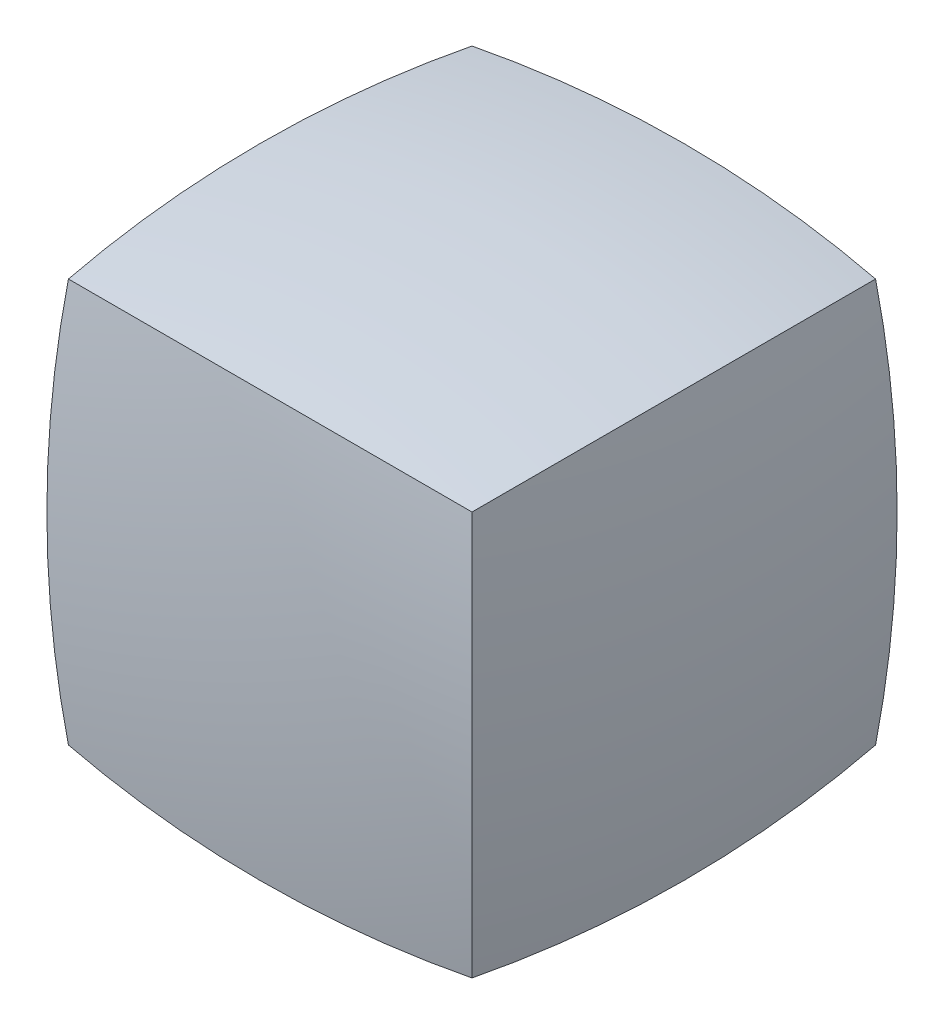
ISO-10303-21;
HEADER;
FILE_DESCRIPTION(('STEP AP214'),'2;1');
FILE_NAME('part.step','',(''),(''),'','','');
FILE_SCHEMA(('AUTOMOTIVE_DESIGN { 1 0 10303 214 1 1 1 1 }'));
ENDSEC;
DATA;
#1=APPLICATION_CONTEXT('core data for automotive mechanical design processes');
#2=APPLICATION_PROTOCOL_DEFINITION('international standard','automotive_design',2000,#1);
#3=PRODUCT_CONTEXT('',#1,'mechanical');
#4=PRODUCT('Part','Part','',(#3));
#5=PRODUCT_RELATED_PRODUCT_CATEGORY('part','',(#4));
#6=PRODUCT_DEFINITION_FORMATION('','',#4);
#7=PRODUCT_DEFINITION_CONTEXT('part definition',#1,'design');
#8=PRODUCT_DEFINITION('design','',#6,#7);
#9=PRODUCT_DEFINITION_SHAPE('','',#8);
#10=(LENGTH_UNIT() NAMED_UNIT(*) SI_UNIT(.MILLI.,.METRE.));
#11=(NAMED_UNIT(*) PLANE_ANGLE_UNIT() SI_UNIT($,.RADIAN.));
#12=(NAMED_UNIT(*) SI_UNIT($,.STERADIAN.) SOLID_ANGLE_UNIT());
#13=UNCERTAINTY_MEASURE_WITH_UNIT(LENGTH_MEASURE(1.E-05),#10,'distance_accuracy_value','');
#14=(GEOMETRIC_REPRESENTATION_CONTEXT(3) GLOBAL_UNCERTAINTY_ASSIGNED_CONTEXT((#13)) GLOBAL_UNIT_ASSIGNED_CONTEXT((#10,
#11,#12)) REPRESENTATION_CONTEXT('',''));
#15=CARTESIAN_POINT('',(0.,0.,0.));
#16=DIRECTION('',(0.,0.,1.));
#17=DIRECTION('',(1.,0.,0.));
#18=AXIS2_PLACEMENT_3D('',#15,#16,#17);
#19=CARTESIAN_POINT('',(-9.22831784490347E-13,88.1031249515609,9.34974848822185E-13));
#20=DIRECTION('',(0.,0.,1.));
#21=DIRECTION('',(0.,1.,0.));
#22=AXIS2_PLACEMENT_3D('',#19,#20,#21);
#23=SPHERICAL_SURFACE('',#22,101.6);
#24=CARTESIAN_POINT('',(-44.0515624757809,44.0515624757804,4.67487424411092E-13));
#25=DIRECTION('',(0.707106781186544,0.707106781186551,0.));
#26=DIRECTION('',(-0.707106781186551,0.707106781186544,0.));
#27=AXIS2_PLACEMENT_3D('',#24,#25,#26);
#28=CIRCLE('',#27,80.258829339113);
#29=CARTESIAN_POINT('',(12.0560620293977,-12.0560620293977,12.0560620293978));
#30=VERTEX_POINT('',#29);
#31=CARTESIAN_POINT('',(12.0560620293978,-12.0560620293975,-12.0560620293976));
#32=VERTEX_POINT('',#31);
#33=EDGE_CURVE('E85',#30,#32,#28,.T.);
#34=ORIENTED_EDGE('',*,*,#33,.F.);
#35=CARTESIAN_POINT('',(-3.07610594830116E-13,44.0515624757804,-44.05156247578));
#36=DIRECTION('',(0.,-0.707106781186544,-0.707106781186551));
#37=DIRECTION('',(0.,0.707106781186551,-0.707106781186544));
#38=AXIS2_PLACEMENT_3D('',#35,#36,#37);
#39=CIRCLE('',#38,80.2588293391125);
#40=CARTESIAN_POINT('',(-12.0560620293978,-12.0560620293979,12.0560620293977));
#41=VERTEX_POINT('',#40);
#42=EDGE_CURVE('E83',#30,#41,#39,.T.);
#43=ORIENTED_EDGE('',*,*,#42,.T.);
#44=CARTESIAN_POINT('',(44.05156247578,44.0515624757804,7.75098019241208E-13));
#45=DIRECTION('',(-0.707106781186551,0.707106781186544,0.));
#46=DIRECTION('',(-0.707106781186544,-0.707106781186551,0.));
#47=AXIS2_PLACEMENT_3D('',#44,#45,#46);
#48=CIRCLE('',#47,80.2588293391125);
#49=CARTESIAN_POINT('',(-12.0560620293976,-12.0560620293977,-12.0560620293978));
#50=VERTEX_POINT('',#49);
#51=EDGE_CURVE('E92',#50,#41,#48,.T.);
#52=ORIENTED_EDGE('',*,*,#51,.F.);
#53=CARTESIAN_POINT('',(-9.22831784490347E-13,44.0515624757804,44.0515624757809));
#54=DIRECTION('',(0.,0.707106781186551,-0.707106781186544));
#55=DIRECTION('',(0.,0.707106781186544,0.707106781186551));
#56=AXIS2_PLACEMENT_3D('',#53,#54,#55);
#57=CIRCLE('',#56,80.258829339113);
#58=EDGE_CURVE('E95',#32,#50,#57,.T.);
#59=ORIENTED_EDGE('',*,*,#58,.F.);
#60=EDGE_LOOP('',(#34,#43,#52,#59));
#61=FACE_BOUND('',#60,.T.);
#62=ADVANCED_FACE('F34',(#61),#23,.T.);
#63=CARTESIAN_POINT('',(88.1031249515609,0.,6.15221189660231E-13));
#64=DIRECTION('',(0.,-1.,0.));
#65=DIRECTION('',(1.,0.,0.));
#66=AXIS2_PLACEMENT_3D('',#63,#64,#65);
#67=SPHERICAL_SURFACE('',#66,101.6);
#68=CARTESIAN_POINT('',(44.0515624757806,0.,-44.0515624757801));
#69=DIRECTION('',(-0.707106781186544,0.,-0.707106781186551));
#70=DIRECTION('',(-0.707106781186551,0.,0.707106781186544));
#71=AXIS2_PLACEMENT_3D('',#68,#69,#70);
#72=CIRCLE('',#71,80.2588293391127);
#73=CARTESIAN_POINT('',(-12.0560620293978,12.0560620293978,12.0560620293977));
#74=VERTEX_POINT('',#73);
#75=EDGE_CURVE('E99',#41,#74,#72,.T.);
#76=ORIENTED_EDGE('',*,*,#75,.T.);
#77=CARTESIAN_POINT('',(44.05156247578,-44.0515624757805,1.47733765249139E-13));
#78=DIRECTION('',(-0.707106781186551,-0.707106781186544,0.));
#79=DIRECTION('',(0.707106781186544,-0.707106781186551,0.));
#80=AXIS2_PLACEMENT_3D('',#77,#78,#79);
#81=CIRCLE('',#80,80.2588293391125);
#82=CARTESIAN_POINT('',(-12.0560620293976,12.0560620293979,-12.0560620293978));
#83=VERTEX_POINT('',#82);
#84=EDGE_CURVE('E49',#74,#83,#81,.T.);
#85=ORIENTED_EDGE('',*,*,#84,.T.);
#86=CARTESIAN_POINT('',(44.05156247578,0.,44.0515624757807));
#87=DIRECTION('',(0.707106781186554,0.,-0.707106781186541));
#88=DIRECTION('',(-0.707106781186541,0.,-0.707106781186554));
#89=AXIS2_PLACEMENT_3D('',#86,#87,#88);
#90=CIRCLE('',#89,80.2588293391127);
#91=EDGE_CURVE('E89',#50,#83,#90,.T.);
#92=ORIENTED_EDGE('',*,*,#91,.F.);
#93=ORIENTED_EDGE('',*,*,#51,.T.);
#94=EDGE_LOOP('',(#76,#85,#92,#93));
#95=FACE_BOUND('',#94,.T.);
#96=ADVANCED_FACE('F106',(#95),#67,.T.);
#97=CARTESIAN_POINT('',(-9.22831784490347E-13,0.,88.1031249515609));
#98=DIRECTION('',(0.,-1.,0.));
#99=DIRECTION('',(0.,0.,1.));
#100=AXIS2_PLACEMENT_3D('',#97,#98,#99);
#101=SPHERICAL_SURFACE('',#100,101.6);
#102=ORIENTED_EDGE('',*,*,#91,.T.);
#103=CARTESIAN_POINT('',(-9.22831784490347E-13,-44.0515624757805,44.0515624757803));
#104=DIRECTION('',(0.,-0.707106781186546,-0.707106781186549));
#105=DIRECTION('',(0.,0.707106781186549,-0.707106781186546));
#106=AXIS2_PLACEMENT_3D('',#103,#104,#105);
#107=CIRCLE('',#106,80.2588293391127);
#108=CARTESIAN_POINT('',(12.0560620293977,12.0560620293976,-12.0560620293976));
#109=VERTEX_POINT('',#108);
#110=EDGE_CURVE('E79',#83,#109,#107,.T.);
#111=ORIENTED_EDGE('',*,*,#110,.T.);
#112=CARTESIAN_POINT('',(-44.0515624757809,0.,44.0515624757804));
#113=DIRECTION('',(0.707106781186544,0.,0.707106781186551));
#114=DIRECTION('',(0.707106781186551,0.,-0.707106781186544));
#115=AXIS2_PLACEMENT_3D('',#112,#113,#114);
#116=CIRCLE('',#115,80.258829339113);
#117=EDGE_CURVE('E78',#32,#109,#116,.T.);
#118=ORIENTED_EDGE('',*,*,#117,.F.);
#119=ORIENTED_EDGE('',*,*,#58,.T.);
#120=EDGE_LOOP('',(#102,#111,#118,#119));
#121=FACE_BOUND('',#120,.T.);
#122=ADVANCED_FACE('F103',(#121),#101,.T.);
#123=CARTESIAN_POINT('',(-88.1031249515609,0.,0.));
#124=DIRECTION('',(0.,-1.,0.));
#125=DIRECTION('',(-1.,0.,0.));
#126=AXIS2_PLACEMENT_3D('',#123,#124,#125);
#127=SPHERICAL_SURFACE('',#126,101.6);
#128=ORIENTED_EDGE('',*,*,#117,.T.);
#129=CARTESIAN_POINT('',(-44.0515624757809,-44.0515624757805,-1.59876829580977E-13));
#130=DIRECTION('',(0.707106781186544,-0.707106781186551,0.));
#131=DIRECTION('',(0.707106781186551,0.707106781186544,0.));
#132=AXIS2_PLACEMENT_3D('',#129,#130,#131);
#133=CIRCLE('',#132,80.258829339113);
#134=CARTESIAN_POINT('',(12.0560620293977,12.0560620293976,12.0560620293978));
#135=VERTEX_POINT('',#134);
#136=EDGE_CURVE('E72',#109,#135,#133,.T.);
#137=ORIENTED_EDGE('',*,*,#136,.T.);
#138=CARTESIAN_POINT('',(-44.0515624757803,0.,-44.0515624757804));
#139=DIRECTION('',(0.707106781186549,0.,-0.707106781186546));
#140=DIRECTION('',(-0.707106781186546,0.,-0.707106781186549));
#141=AXIS2_PLACEMENT_3D('',#138,#139,#140);
#142=CIRCLE('',#141,80.2588293391127);
#143=EDGE_CURVE('E42',#135,#30,#142,.T.);
#144=ORIENTED_EDGE('',*,*,#143,.T.);
#145=ORIENTED_EDGE('',*,*,#33,.T.);
#146=EDGE_LOOP('',(#128,#137,#144,#145));
#147=FACE_BOUND('',#146,.T.);
#148=ADVANCED_FACE('F36',(#147),#127,.T.);
#149=CARTESIAN_POINT('',(3.07610594830116E-13,0.,-88.1031249515609));
#150=DIRECTION('',(0.,-1.,0.));
#151=DIRECTION('',(0.,0.,-1.));
#152=AXIS2_PLACEMENT_3D('',#149,#150,#151);
#153=SPHERICAL_SURFACE('',#152,101.6);
#154=ORIENTED_EDGE('',*,*,#143,.F.);
#155=CARTESIAN_POINT('',(-3.07610594830116E-13,-44.0515624757805,-44.0515624757806));
#156=DIRECTION('',(0.,-0.707106781186549,0.707106781186546));
#157=DIRECTION('',(0.,-0.707106781186546,-0.707106781186549));
#158=AXIS2_PLACEMENT_3D('',#155,#156,#157);
#159=CIRCLE('',#158,80.2588293391128);
#160=EDGE_CURVE('E11',#135,#74,#159,.T.);
#161=ORIENTED_EDGE('',*,*,#160,.T.);
#162=ORIENTED_EDGE('',*,*,#75,.F.);
#163=ORIENTED_EDGE('',*,*,#42,.F.);
#164=EDGE_LOOP('',(#154,#161,#162,#163));
#165=FACE_BOUND('',#164,.T.);
#166=ADVANCED_FACE('F81',(#165),#153,.T.);
#167=CARTESIAN_POINT('',(-9.22831784490347E-13,-88.1031249515609,-3.19753659161953E-13));
#168=DIRECTION('',(0.,0.,-1.));
#169=DIRECTION('',(0.,-1.,0.));
#170=AXIS2_PLACEMENT_3D('',#167,#168,#169);
#171=SPHERICAL_SURFACE('',#170,101.6);
#172=ORIENTED_EDGE('',*,*,#84,.F.);
#173=ORIENTED_EDGE('',*,*,#160,.F.);
#174=ORIENTED_EDGE('',*,*,#136,.F.);
#175=ORIENTED_EDGE('',*,*,#110,.F.);
#176=EDGE_LOOP('',(#172,#173,#174,#175));
#177=FACE_BOUND('',#176,.T.);
#178=ADVANCED_FACE('F71',(#177),#171,.T.);
#179=CLOSED_SHELL('',(#62,#96,#122,#148,#166,#178));
#180=MANIFOLD_SOLID_BREP('B2',#179);
#181=ADVANCED_BREP_SHAPE_REPRESENTATION('',(#18,#180),#14);
#182=SHAPE_DEFINITION_REPRESENTATION(#9,#181);
ENDSEC;
END-ISO-10303-21;
